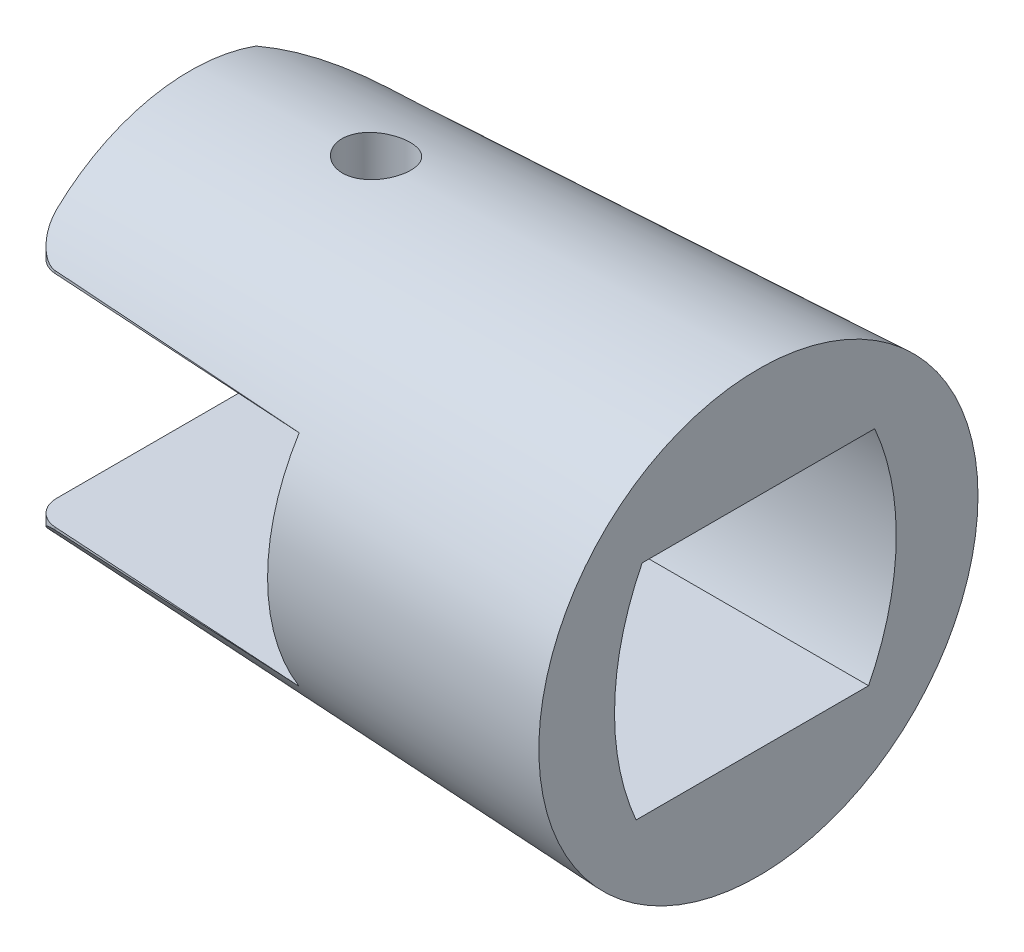
ISO-10303-21;
HEADER;
FILE_DESCRIPTION(('STEP AP214'),'2;1');
FILE_NAME('part.step','',(''),(''),'','','');
FILE_SCHEMA(('AUTOMOTIVE_DESIGN { 1 0 10303 214 1 1 1 1 }'));
ENDSEC;
DATA;
#1=APPLICATION_CONTEXT('core data for automotive mechanical design processes');
#2=APPLICATION_PROTOCOL_DEFINITION('international standard','automotive_design',2000,#1);
#3=PRODUCT_CONTEXT('',#1,'mechanical');
#4=PRODUCT('Part','Part','',(#3));
#5=PRODUCT_RELATED_PRODUCT_CATEGORY('part','',(#4));
#6=PRODUCT_DEFINITION_FORMATION('','',#4);
#7=PRODUCT_DEFINITION_CONTEXT('part definition',#1,'design');
#8=PRODUCT_DEFINITION('design','',#6,#7);
#9=PRODUCT_DEFINITION_SHAPE('','',#8);
#10=(LENGTH_UNIT() NAMED_UNIT(*) SI_UNIT(.MILLI.,.METRE.));
#11=(NAMED_UNIT(*) PLANE_ANGLE_UNIT() SI_UNIT($,.RADIAN.));
#12=(NAMED_UNIT(*) SI_UNIT($,.STERADIAN.) SOLID_ANGLE_UNIT());
#13=UNCERTAINTY_MEASURE_WITH_UNIT(LENGTH_MEASURE(1.E-05),#10,'distance_accuracy_value','');
#14=(GEOMETRIC_REPRESENTATION_CONTEXT(3) GLOBAL_UNCERTAINTY_ASSIGNED_CONTEXT((#13)) GLOBAL_UNIT_ASSIGNED_CONTEXT((#10,
#11,#12)) REPRESENTATION_CONTEXT('',''));
#15=CARTESIAN_POINT('',(0.,0.,0.));
#16=DIRECTION('',(0.,0.,1.));
#17=DIRECTION('',(1.,0.,0.));
#18=AXIS2_PLACEMENT_3D('',#15,#16,#17);
#19=CARTESIAN_POINT('',(-11.,0.,10.));
#20=DIRECTION('',(1.,0.,0.));
#21=DIRECTION('',(0.,0.,-1.));
#22=AXIS2_PLACEMENT_3D('',#19,#20,#21);
#23=PLANE('',#22);
#24=DIRECTION('',(0.,0.,-1.));
#25=VECTOR('',#24,1.);
#26=CARTESIAN_POINT('',(-11.,4.25,10.));
#27=LINE('',#26,#25);
#28=CARTESIAN_POINT('',(-11.,4.25,6.77772085586298));
#29=VERTEX_POINT('',#28);
#30=CARTESIAN_POINT('',(-11.,4.25,4.5));
#31=VERTEX_POINT('',#30);
#32=EDGE_CURVE('E238',#29,#31,#27,.T.);
#33=ORIENTED_EDGE('',*,*,#32,.T.);
#34=CARTESIAN_POINT('',(-11.,-0.249999999999947,-4.43028554974591));
#35=DIRECTION('',(1.,0.,0.));
#36=DIRECTION('',(0.,0.,-1.));
#37=AXIS2_PLACEMENT_3D('',#34,#35,#36);
#38=CIRCLE('',#37,10.);
#39=CARTESIAN_POINT('',(-11.,-4.25,4.73486584016575));
#40=VERTEX_POINT('',#39);
#41=EDGE_CURVE('E359',#31,#40,#38,.T.);
#42=ORIENTED_EDGE('',*,*,#41,.T.);
#43=DIRECTION('',(0.,0.,-1.));
#44=VECTOR('',#43,1.);
#45=CARTESIAN_POINT('',(-11.,-4.25,10.));
#46=LINE('',#45,#44);
#47=CARTESIAN_POINT('',(-11.,-4.25,6.77772085586298));
#48=VERTEX_POINT('',#47);
#49=EDGE_CURVE('E242',#48,#40,#46,.T.);
#50=ORIENTED_EDGE('',*,*,#49,.F.);
#51=CARTESIAN_POINT('',(-11.,0.,0.));
#52=DIRECTION('',(1.,0.,0.));
#53=DIRECTION('',(0.,0.,-1.));
#54=AXIS2_PLACEMENT_3D('',#51,#52,#53);
#55=CIRCLE('',#54,8.);
#56=EDGE_CURVE('E425',#48,#29,#55,.F.);
#57=ORIENTED_EDGE('',*,*,#56,.T.);
#58=EDGE_LOOP('',(#33,#42,#50,#57));
#59=FACE_BOUND('',#58,.T.);
#60=ADVANCED_FACE('F39',(#59),#23,.F.);
#61=CARTESIAN_POINT('',(-22.,0.,0.));
#62=DIRECTION('',(1.,0.,0.));
#63=DIRECTION('',(0.,0.,-1.));
#64=AXIS2_PLACEMENT_3D('',#61,#62,#63);
#65=CONICAL_SURFACE('',#64,7.5,0.0454232794215771);
#66=CARTESIAN_POINT('',(-16.1991105064426,7.64213239860376,-1.36838948473856));
#67=CARTESIAN_POINT('',(-16.1508958141531,7.63542076172434,-1.41830655928894));
#68=CARTESIAN_POINT('',(-16.0984640394933,7.62911627347668,-1.46425428633825));
#69=CARTESIAN_POINT('',(-15.9865616989317,7.61798266028014,-1.54688930956662));
#70=CARTESIAN_POINT('',(-15.9270857940176,7.6131546644773,-1.58356951471042));
#71=CARTESIAN_POINT('',(-15.802712395997,7.60556121739957,-1.64657757660265));
#72=CARTESIAN_POINT('',(-15.7378122849934,7.60279676852596,-1.6729003991531));
#73=CARTESIAN_POINT('',(-15.6044894198699,7.59976966951342,-1.71435496620886));
#74=CARTESIAN_POINT('',(-15.5360675880329,7.59950636768161,-1.72948962492742));
#75=CARTESIAN_POINT('',(-15.3986493193805,7.601678960494,-1.74800214952895));
#76=CARTESIAN_POINT('',(-15.3296735239488,7.60407800564145,-1.75153790545443));
#77=CARTESIAN_POINT('',(-15.1922197490342,7.61147677366023,-1.74724166449967));
#78=CARTESIAN_POINT('',(-15.1237417778008,7.61647653952937,-1.73940947966908));
#79=CARTESIAN_POINT('',(-14.9893122034088,7.62878729562398,-1.71270870352584));
#80=CARTESIAN_POINT('',(-14.9233566968642,7.63609453825562,-1.69385796559172));
#81=CARTESIAN_POINT('',(-14.7956032365479,7.65254635393307,-1.64575063446263));
#82=CARTESIAN_POINT('',(-14.7338057780463,7.66169114533623,-1.61649280426639));
#83=CARTESIAN_POINT('',(-14.6146164208518,7.68142115811766,-1.54765952743847));
#84=CARTESIAN_POINT('',(-14.5573538680598,7.69203400686407,-1.50786808141507));
#85=CARTESIAN_POINT('',(-14.4502759218419,7.71379780513905,-1.41939866566641));
#86=CARTESIAN_POINT('',(-14.4004616008841,7.72494883185447,-1.37071941842715));
#87=CARTESIAN_POINT('',(-14.308562494205,7.74727150917654,-1.26458252042323));
#88=CARTESIAN_POINT('',(-14.266672691938,7.75843817733606,-1.2069547552206));
#89=CARTESIAN_POINT('',(-14.1932084656516,7.7797615741078,-1.08528800075841));
#90=CARTESIAN_POINT('',(-14.1616339806865,7.78991830868673,-1.02124904938079));
#91=CARTESIAN_POINT('',(-14.1098588735166,7.80851391292312,-0.888725966160254));
#92=CARTESIAN_POINT('',(-14.0896222542327,7.81695816450501,-0.820256681647045));
#93=CARTESIAN_POINT('',(-14.061072971363,7.83165138460125,-0.680648621468626));
#94=CARTESIAN_POINT('',(-14.052758507449,7.83790068446094,-0.609510250519243));
#95=CARTESIAN_POINT('',(-14.0484522952261,7.84778514931267,-0.468304544460963));
#96=CARTESIAN_POINT('',(-14.0521855342659,7.85147635133582,-0.398249476364143));
#97=CARTESIAN_POINT('',(-14.071329170513,7.85640983357746,-0.259667810323408));
#98=CARTESIAN_POINT('',(-14.0867385243256,7.85765233257991,-0.191141076368558));
#99=CARTESIAN_POINT('',(-14.128492897101,7.85785284225483,-0.058605743907525));
#100=CARTESIAN_POINT('',(-14.1546754138614,7.85684385409155,0.00545411413245929));
#101=CARTESIAN_POINT('',(-14.2172061762014,7.8529554420828,0.128339672817716));
#102=CARTESIAN_POINT('',(-14.2535547688558,7.85007595437311,0.187165194669775));
#103=CARTESIAN_POINT('',(-14.33564939293,7.84290661884702,0.298331454790711));
#104=CARTESIAN_POINT('',(-14.3814541520736,7.83860785145139,0.35062822183059));
#105=CARTESIAN_POINT('',(-14.4810394588978,7.82917620282735,0.446889941699957));
#106=CARTESIAN_POINT('',(-14.5348206521234,7.82404325408415,0.490854219511729));
#107=CARTESIAN_POINT('',(-14.6496931312128,7.81345670361802,0.569825204161493));
#108=CARTESIAN_POINT('',(-14.7108758925215,7.80799962872127,0.604698457611458));
#109=CARTESIAN_POINT('',(-14.8382444432748,7.79739564393625,0.6637044897007));
#110=CARTESIAN_POINT('',(-14.9044303303778,7.79224874010588,0.687837058623818));
#111=CARTESIAN_POINT('',(-15.0402241368509,7.78270476049587,0.72473880536946));
#112=CARTESIAN_POINT('',(-15.1098440907648,7.77831060474813,0.737464507047952));
#113=CARTESIAN_POINT('',(-15.2502912846662,7.77060175559334,0.751001880492983));
#114=CARTESIAN_POINT('',(-15.3211184785031,7.767287021019,0.751814006675144));
#115=CARTESIAN_POINT('',(-15.4615301135133,7.76186641491048,0.741504998097269));
#116=CARTESIAN_POINT('',(-15.5311193880888,7.75975362099767,0.730453277969864));
#117=CARTESIAN_POINT('',(-15.6674801831399,7.75662221504508,0.696824735222845));
#118=CARTESIAN_POINT('',(-15.7342517323173,7.75560359185731,0.674248030029435));
#119=CARTESIAN_POINT('',(-15.8628851054713,7.75439899973845,0.618287283442594));
#120=CARTESIAN_POINT('',(-15.9247600998771,7.75421071707963,0.584933551104948));
#121=CARTESIAN_POINT('',(-16.0420578125317,7.75426433037923,0.508343495615129));
#122=CARTESIAN_POINT('',(-16.0974803849768,7.7545062360565,0.465106949208793));
#123=CARTESIAN_POINT('',(-16.2004511088615,7.75494768906834,0.369839556377424));
#124=CARTESIAN_POINT('',(-16.2479773370052,7.75514711889195,0.317785010074491));
#125=CARTESIAN_POINT('',(-16.33362259248,7.75501450579899,0.206439946900698));
#126=CARTESIAN_POINT('',(-16.3717416868938,7.75468246667248,0.147149481634012));
#127=CARTESIAN_POINT('',(-16.437483487879,7.75305536372848,0.0230317553152771));
#128=CARTESIAN_POINT('',(-16.4651077721284,7.7517604447467,-0.0417946717232883));
#129=CARTESIAN_POINT('',(-16.5090837599272,7.74789483036569,-0.175125147731818));
#130=CARTESIAN_POINT('',(-16.5254361602932,7.74532421384571,-0.243628969086713));
#131=CARTESIAN_POINT('',(-16.5463860889201,7.73877397471131,-0.38207858523554));
#132=CARTESIAN_POINT('',(-16.5510276678073,7.73479969655463,-0.452017975678318));
#133=CARTESIAN_POINT('',(-16.5485915654112,7.72548754817343,-0.59161330924282));
#134=CARTESIAN_POINT('',(-16.5415116273113,7.72014941552488,-0.661269195191051));
#135=CARTESIAN_POINT('',(-16.5158437856867,7.70833750676838,-0.798518169432213));
#136=CARTESIAN_POINT('',(-16.4972245671329,7.70186067486092,-0.866105117574989));
#137=CARTESIAN_POINT('',(-16.4490137309468,7.68820545400156,-0.997124780343338));
#138=CARTESIAN_POINT('',(-16.4194307611689,7.68102762125416,-1.06056072287359));
#139=CARTESIAN_POINT('',(-16.3591222362737,7.66840925157617,-1.16590935920253));
#140=CARTESIAN_POINT('',(-16.3306707233596,7.66299948879188,-1.20914558818589));
#141=CARTESIAN_POINT('',(-16.2686303426236,7.65236191060591,-1.29178587179423));
#142=CARTESIAN_POINT('',(-16.2350414332522,7.64713409667618,-1.33118989542148));
#143=CARTESIAN_POINT('',(-16.1991105064426,7.64213239860376,-1.36838948473856));
#144=B_SPLINE_CURVE_WITH_KNOTS('',3,(#66,#67,#68,#69,#70,#71,#72,#73,#74,#75,#76,#77,#78,#79,
#80,#81,#82,#83,#84,#85,#86,#87,#88,#89,#90,#91,#92,#93,#94,#95,#96,#97,#98,#99,#100,#101,#102,
#103,#104,#105,#106,#107,#108,#109,#110,#111,#112,#113,#114,#115,#116,#117,#118,#119,#120,#121,
#122,#123,#124,#125,#126,#127,#128,#129,#130,#131,#132,#133,#134,#135,#136,#137,#138,#139,#140,
#141,#142,#143),.UNSPECIFIED.,.T.,.F.,(4,2,2,2,2,2,2,2,2,2,2,2,2,2,2,2,2,2,2,2,2,2,2,2,2,2,2,2,
2,2,2,2,2,2,2,2,2,2,4),(0.,0.20898815908834,0.41813574427288,0.627384860280111,
0.836579453344756,1.04291430318027,1.24925256446439,1.45525741870395,1.66128676715023,
1.87192122846896,2.08258598981495,2.29790285538215,2.51321844877551,2.72784649621161,
2.94244212990628,3.15217414289225,3.36188741612846,3.56854703875268,3.77521371769965,
3.98320475141169,4.19121262735113,4.40212098182154,4.61303345418124,4.82474642188118,
5.03645131426148,5.24692425172714,5.45739504476097,5.66727899295867,5.87716768293301,
6.08762970444704,6.29809022510347,6.50851909483774,6.71893495490389,6.92855814100928,
7.13822169186476,7.3484567293843,7.55852629197703,7.71426880857834,7.87001258483612),.UNSPECIFIED.);
#145=CARTESIAN_POINT('',(-16.1991105064426,7.64213239860376,-1.36838948473856));
#146=VERTEX_POINT('',#145);
#147=EDGE_CURVE('E176',#146,#146,#144,.T.);
#148=ORIENTED_EDGE('',*,*,#147,.T.);
#149=EDGE_LOOP('',(#148));
#150=FACE_BOUND('',#149,.T.);
#151=CARTESIAN_POINT('',(-41.5118530495364,0.,4.90960169713127));
#152=DIRECTION('',(-0.0611115794993297,0.,0.998130940734279));
#153=DIRECTION('',(0.998130940734279,0.,0.0611115794993297));
#154=AXIS2_PLACEMENT_3D('',#151,#152,#153);
#155=ELLIPSE('',#154,108.213494771976,4.43044815934391);
#156=CARTESIAN_POINT('',(-21.0611115794994,-4.35030922266395,6.16171909191617));
#157=VERTEX_POINT('',#156);
#158=EDGE_CURVE('E400',#48,#157,#155,.F.);
#159=ORIENTED_EDGE('',*,*,#158,.T.);
#160=CARTESIAN_POINT('',(-21.0611115794993,-4.35030922266395,6.16171909191617));
#161=CARTESIAN_POINT('',(-21.0960747914109,-4.35051356340758,6.15962202294587));
#162=CARTESIAN_POINT('',(-21.1307813214346,-4.35346778045731,6.15561243833207));
#163=CARTESIAN_POINT('',(-21.1985190771024,-4.36415418241963,6.14426807244674));
#164=CARTESIAN_POINT('',(-21.2315642056245,-4.3718351604082,6.13696914977953));
#165=CARTESIAN_POINT('',(-21.3035295203859,-4.39369648239994,6.11731554569819));
#166=CARTESIAN_POINT('',(-21.3418761871241,-4.40901577852048,6.10415620522647));
#167=CARTESIAN_POINT('',(-21.4149283606298,-4.44443557078691,6.07430260660561));
#168=CARTESIAN_POINT('',(-21.4496163023613,-4.46455774127447,6.05759236262458));
#169=CARTESIAN_POINT('',(-21.531946468789,-4.51931086063731,6.01225519576181));
#170=CARTESIAN_POINT('',(-21.5771775571261,-4.55610872004904,5.98189606961668));
#171=CARTESIAN_POINT('',(-21.6598615980811,-4.6342222492668,5.91681901434334));
#172=CARTESIAN_POINT('',(-21.6972980555852,-4.67554722314516,5.88209208602675));
#173=CARTESIAN_POINT('',(-21.7830311966419,-4.78319627199736,5.79019145424798));
#174=CARTESIAN_POINT('',(-21.8267397409008,-4.85127319447803,5.73079069632704));
#175=CARTESIAN_POINT('',(-21.8996051814965,-4.98975683289049,5.60620400269983));
#176=CARTESIAN_POINT('',(-21.9287525468712,-5.06016504269773,5.54101431065619));
#177=CARTESIAN_POINT('',(-21.9669423984771,-5.18258484226127,5.42388394775105));
#178=CARTESIAN_POINT('',(-21.9792550755708,-5.2345697331447,5.37296218184321));
#179=CARTESIAN_POINT('',(-21.9957467088538,-5.33772131710358,5.26944127270405));
#180=CARTESIAN_POINT('',(-21.9999586548459,-5.38889048351514,5.2168498232289));
#181=CARTESIAN_POINT('',(-21.9999999999995,-5.43942713814805,5.16358716482823));
#182=B_SPLINE_CURVE_WITH_KNOTS('',3,(#160,#161,#162,#163,#164,#165,#166,#167,#168,#169,#170,
#171,#172,#173,#174,#175,#176,#177,#178,#179,#180,#181),.UNSPECIFIED.,.F.,.F.,(4,2,2,2,2,2,2,2,
2,2,4),(0.,0.104737956290573,0.20836074561613,0.337663511366164,0.467561208549421,
0.663680584398123,0.860210864778958,1.15972124568397,1.45942741390104,1.68039223758089,
1.90045527217779),.UNSPECIFIED.);
#183=CARTESIAN_POINT('',(-22.,-5.43942765765587,5.16358765802045));
#184=VERTEX_POINT('',#183);
#185=EDGE_CURVE('E292',#157,#184,#182,.T.);
#186=ORIENTED_EDGE('',*,*,#185,.T.);
#187=CARTESIAN_POINT('',(-22.,0.,0.));
#188=DIRECTION('',(1.,0.,0.));
#189=DIRECTION('',(0.,0.,-1.));
#190=AXIS2_PLACEMENT_3D('',#187,#188,#189);
#191=CIRCLE('',#190,7.5);
#192=CARTESIAN_POINT('',(-21.9999999999998,-7.05225000259581,-2.55260061523294));
#193=VERTEX_POINT('',#192);
#194=EDGE_CURVE('E257',#184,#193,#191,.T.);
#195=ORIENTED_EDGE('',*,*,#194,.T.);
#196=CARTESIAN_POINT('',(-16.5272227634073,-3.91896344353208,-6.684687530857));
#197=CARTESIAN_POINT('',(-16.6427127671059,-3.95329674635129,-6.65847955556438));
#198=CARTESIAN_POINT('',(-16.7566693164258,-3.99085174347405,-6.63004153669327));
#199=CARTESIAN_POINT('',(-16.9814370959532,-4.07124785328741,-6.56895905885342));
#200=CARTESIAN_POINT('',(-17.0922510678245,-4.11408417226116,-6.53631841332278));
#201=CARTESIAN_POINT('',(-17.3105332665758,-4.20381588665415,-6.46714088297935));
#202=CARTESIAN_POINT('',(-17.4180105859096,-4.25069863463741,-6.43061606093192));
#203=CARTESIAN_POINT('',(-17.6301048386284,-4.34772844122679,-6.35373913994798));
#204=CARTESIAN_POINT('',(-17.7347210411814,-4.39787632300832,-6.31338607468899));
#205=CARTESIAN_POINT('',(-18.0447644315248,-4.5521525011536,-6.18664455827059));
#206=CARTESIAN_POINT('',(-18.2460892693231,-4.65998636071397,-6.09466885439665));
#207=CARTESIAN_POINT('',(-18.6388142973702,-4.88064755111759,-5.89629879498852));
#208=CARTESIAN_POINT('',(-18.8302055665367,-4.99347920742176,-5.78989177859903));
#209=CARTESIAN_POINT('',(-19.2013077328751,-5.21918797308576,-5.56413300492337));
#210=CARTESIAN_POINT('',(-19.3811286353753,-5.33204927424095,-5.4449462930683));
#211=CARTESIAN_POINT('',(-19.7315405271321,-5.5563305825324,-5.19258525325173));
#212=CARTESIAN_POINT('',(-19.902133820893,-5.66775094419051,-5.05941444234583));
#213=CARTESIAN_POINT('',(-20.2334519196861,-5.88654777947444,-4.77921817415432));
#214=CARTESIAN_POINT('',(-20.3941996852896,-5.99393341697105,-4.63222714993483));
#215=CARTESIAN_POINT('',(-20.7055597270612,-6.20270444576696,-4.32401521420343));
#216=CARTESIAN_POINT('',(-20.8561739450322,-6.30409098616918,-4.16279704268034));
#217=CARTESIAN_POINT('',(-21.1878961239379,-6.52657567812968,-3.77774033897472));
#218=CARTESIAN_POINT('',(-21.3653992935145,-6.64501396174254,-3.54918276892559));
#219=CARTESIAN_POINT('',(-21.6995216755857,-6.86375180811079,-3.06823085541814));
#220=CARTESIAN_POINT('',(-21.8560787946518,-6.96399774059342,-2.81576926932262));
#221=CARTESIAN_POINT('',(-22.0003080623877,-7.0524389734962,-2.55203732001921));
#222=B_SPLINE_CURVE_WITH_KNOTS('',3,(#196,#197,#198,#199,#200,#201,#202,#203,#204,#205,#206,
#207,#208,#209,#210,#211,#212,#213,#214,#215,#216,#217,#218,#219,#220,#221),.UNSPECIFIED.,.F.,
.F.,(4,2,2,2,2,2,2,2,2,2,2,2,4),(0.,0.369742220096412,0.739151272096876,1.10744485071781,
1.47583164236118,2.21361214682884,2.95204415797171,3.68188313790468,4.41153899812975,
5.13942280519199,5.86716673466465,6.80312857828965,7.74180629803889),.UNSPECIFIED.);
#223=CARTESIAN_POINT('',(-17.4146827218211,-4.25,-6.43096361755301));
#224=VERTEX_POINT('',#223);
#225=EDGE_CURVE('E230',#224,#193,#222,.T.);
#226=ORIENTED_EDGE('',*,*,#225,.F.);
#227=CARTESIAN_POINT('',(-33.8126852718489,-4.25,-5.5155871153025));
#228=CARTESIAN_POINT('',(-31.3853699075223,-4.25,-5.65483903287506));
#229=CARTESIAN_POINT('',(-28.957947196194,-4.25,-5.79220398289213));
#230=CARTESIAN_POINT('',(-24.102926214611,-4.25,-6.06376035771553));
#231=CARTESIAN_POINT('',(-21.6753279445077,-4.25,-6.1979517852292));
#232=CARTESIAN_POINT('',(-16.8199914715129,-4.25,-6.46376172585246));
#233=CARTESIAN_POINT('',(-14.392253268658,-4.25,-6.59538023963274));
#234=CARTESIAN_POINT('',(-9.53665959490313,-4.25,-6.85645963504762));
#235=CARTESIAN_POINT('',(-7.10880412393918,-4.25,-6.98592051549281));
#236=CARTESIAN_POINT('',(-1.41358013309213,-4.25,-7.28746835630175));
#237=CARTESIAN_POINT('',(1.85382742252967,-4.25,-7.45881773024276));
#238=CARTESIAN_POINT('',(8.38878193375573,-4.25,-7.79884413360508));
#239=CARTESIAN_POINT('',(11.6563288893827,-4.25,-7.96752116258884));
#240=CARTESIAN_POINT('',(18.1915294937373,-4.25,-8.3026724390855));
#241=CARTESIAN_POINT('',(21.4591831422524,-4.25,-8.46914669074715));
#242=CARTESIAN_POINT('',(27.9945834199728,-4.25,-8.80023650372375));
#243=CARTESIAN_POINT('',(31.2623300491432,-4.25,-8.96485206572805));
#244=CARTESIAN_POINT('',(34.5301144470347,-4.25,-9.1287102280395));
#245=B_SPLINE_CURVE_WITH_KNOTS('',3,(#227,#228,#229,#230,#231,#232,#233,#234,#235,#236,#237,
#238,#239,#240,#241,#242,#243,#244),.UNSPECIFIED.,.F.,.F.,(4,2,2,2,2,2,2,2,4),(0.,
7.29391725989147,14.5878282970991,21.8817374329576,29.1756505895328,38.9913414305139,
48.8070338786212,58.6227078370245,68.438378154867),.UNSPECIFIED.);
#246=CARTESIAN_POINT('',(-11.,-4.25,-6.77772085586298));
#247=VERTEX_POINT('',#246);
#248=EDGE_CURVE('E311',#224,#247,#245,.T.);
#249=ORIENTED_EDGE('',*,*,#248,.T.);
#250=CARTESIAN_POINT('',(-11.,4.25,-6.77772085586298));
#251=VERTEX_POINT('',#250);
#252=EDGE_CURVE('E316',#251,#247,#55,.F.);
#253=ORIENTED_EDGE('',*,*,#252,.F.);
#254=CARTESIAN_POINT('',(-33.8126852718489,4.25,-5.5155871153025));
#255=CARTESIAN_POINT('',(-31.3853699075223,4.25,-5.65483903287507));
#256=CARTESIAN_POINT('',(-28.957947196194,4.25,-5.79220398289214));
#257=CARTESIAN_POINT('',(-24.102926214611,4.25,-6.06376035771554));
#258=CARTESIAN_POINT('',(-21.6753279445077,4.25,-6.19795178522921));
#259=CARTESIAN_POINT('',(-16.8199914715129,4.25,-6.46376172585246));
#260=CARTESIAN_POINT('',(-14.392253268658,4.25,-6.59538023963274));
#261=CARTESIAN_POINT('',(-9.53665959490313,4.25,-6.85645963504762));
#262=CARTESIAN_POINT('',(-7.10880412393918,4.25,-6.98592051549281));
#263=CARTESIAN_POINT('',(-1.41358013309214,4.25,-7.28746835630175));
#264=CARTESIAN_POINT('',(1.85382742252966,4.25,-7.45881773024276));
#265=CARTESIAN_POINT('',(8.38878193375571,4.25,-7.79884413360508));
#266=CARTESIAN_POINT('',(11.6563288893827,4.25,-7.96752116258884));
#267=CARTESIAN_POINT('',(18.1915294937373,4.25,-8.3026724390855));
#268=CARTESIAN_POINT('',(21.4591831422524,4.25,-8.46914669074715));
#269=CARTESIAN_POINT('',(27.9945834199728,4.25,-8.80023650372375));
#270=CARTESIAN_POINT('',(31.2623300491432,4.25,-8.96485206572805));
#271=CARTESIAN_POINT('',(34.5301144470347,4.25,-9.1287102280395));
#272=B_SPLINE_CURVE_WITH_KNOTS('',3,(#254,#255,#256,#257,#258,#259,#260,#261,#262,#263,#264,
#265,#266,#267,#268,#269,#270,#271),.UNSPECIFIED.,.F.,.F.,(4,2,2,2,2,2,2,2,4),(0.,
7.29391725989147,14.5878282970991,21.8817374329576,29.1756505895328,38.9913414305139,
48.8070338786212,58.6227078370245,68.438378154867),.UNSPECIFIED.);
#273=CARTESIAN_POINT('',(-17.4146827218211,4.25,-6.43096361755301));
#274=VERTEX_POINT('',#273);
#275=EDGE_CURVE('E424',#251,#274,#272,.F.);
#276=ORIENTED_EDGE('',*,*,#275,.T.);
#277=CARTESIAN_POINT('',(-22.0003080623877,7.0524389734962,-2.55203732001921));
#278=CARTESIAN_POINT('',(-21.8865501625451,6.98266926908595,-2.76006889586726));
#279=CARTESIAN_POINT('',(-21.7650667699985,6.90553513148157,-2.96115407159308));
#280=CARTESIAN_POINT('',(-21.508493529345,6.73917648584937,-3.34864268637224));
#281=CARTESIAN_POINT('',(-21.3734265500854,6.64997221400663,-3.53506989034863));
#282=CARTESIAN_POINT('',(-21.0914944642558,6.4620983081212,-3.8926999624019));
#283=CARTESIAN_POINT('',(-20.9446595735615,6.36345279678775,-4.0639395844802));
#284=CARTESIAN_POINT('',(-20.6400538581137,6.15879267743817,-4.39176817948242));
#285=CARTESIAN_POINT('',(-20.4822783291448,6.05277489946614,-4.54835078138103));
#286=CARTESIAN_POINT('',(-20.1578370784349,5.83643149189731,-4.84588988896659));
#287=CARTESIAN_POINT('',(-19.9912387897799,5.72613989346029,-4.98694502527183));
#288=CARTESIAN_POINT('',(-19.6486850111953,5.50289121690271,-5.25481733215771));
#289=CARTESIAN_POINT('',(-19.4727300721882,5.38993429593453,-5.38163533965996));
#290=CARTESIAN_POINT('',(-19.1117869780169,5.16405221946017,-5.62103306771884));
#291=CARTESIAN_POINT('',(-18.9268105416526,5.05112720480102,-5.73363061176831));
#292=CARTESIAN_POINT('',(-18.5472878152095,4.82822203601791,-5.94478562930339));
#293=CARTESIAN_POINT('',(-18.3527425637343,4.71824156428428,-6.04334462203561));
#294=CARTESIAN_POINT('',(-18.0265884245266,4.54434936735566,-6.19261987574077));
#295=CARTESIAN_POINT('',(-17.8980562277181,4.47833109034495,-6.24762842784334));
#296=CARTESIAN_POINT('',(-17.6366586028298,4.35049937851545,-6.3517121623919));
#297=CARTESIAN_POINT('',(-17.5037958087032,4.28868345582808,-6.40079086902872));
#298=CARTESIAN_POINT('',(-17.2332414308166,4.17077976931123,-6.49285379079453));
#299=CARTESIAN_POINT('',(-17.0955443981608,4.11469876746748,-6.53583083417332));
#300=CARTESIAN_POINT('',(-16.8151295178568,4.01037735782446,-6.61527669848076));
#301=CARTESIAN_POINT('',(-16.6724037043015,3.96215013893154,-6.65173458160315));
#302=CARTESIAN_POINT('',(-16.5272227634072,3.91896344353208,-6.68468753085701));
#303=B_SPLINE_CURVE_WITH_KNOTS('',3,(#277,#278,#279,#280,#281,#282,#283,#284,#285,#286,#287,
#288,#289,#290,#291,#292,#293,#294,#295,#296,#297,#298,#299,#300,#301,#302),.UNSPECIFIED.,.F.,
.F.,(4,2,2,2,2,2,2,2,2,2,2,2,4),(0.,0.740833951218997,1.48044090115842,2.21820616396747,
2.95629063927878,3.68937726721113,4.42242077846857,5.15453619976111,5.88657233151188,
6.35021514569359,6.81358104068867,7.27748713433333,7.74216440921874),.UNSPECIFIED.);
#304=CARTESIAN_POINT('',(-21.9999999999999,7.05225000259585,-2.55260061523282));
#305=VERTEX_POINT('',#304);
#306=EDGE_CURVE('E396',#305,#274,#303,.T.);
#307=ORIENTED_EDGE('',*,*,#306,.F.);
#308=CARTESIAN_POINT('',(-22.,5.43942732783755,5.16358776971788));
#309=VERTEX_POINT('',#308);
#310=EDGE_CURVE('E44',#305,#309,#191,.T.);
#311=ORIENTED_EDGE('',*,*,#310,.T.);
#312=CARTESIAN_POINT('',(-21.9999999999997,5.43942692599864,5.16358738831069));
#313=CARTESIAN_POINT('',(-21.999988013143,5.40184320556245,5.20318749921114));
#314=CARTESIAN_POINT('',(-21.9976480658442,5.36390633417556,5.24243191883521));
#315=CARTESIAN_POINT('',(-21.9884703459431,5.2875949713991,5.3199754661269));
#316=CARTESIAN_POINT('',(-21.9816316889269,5.24922039541796,5.35827440638373));
#317=CARTESIAN_POINT('',(-21.9635351279353,5.17197734108679,5.43401065216798));
#318=CARTESIAN_POINT('',(-21.952238686453,5.13310749569211,5.47143734588329));
#319=CARTESIAN_POINT('',(-21.9252941853482,5.05553834603688,5.54484730589776));
#320=CARTESIAN_POINT('',(-21.9096469965899,5.01683900921972,5.58083085941441));
#321=CARTESIAN_POINT('',(-21.8632877834427,4.91690464192796,5.67223267566103));
#322=CARTESIAN_POINT('',(-21.8291655895984,4.85605246576613,5.7263849970058));
#323=CARTESIAN_POINT('',(-21.7490883355968,4.73783831693094,5.82925153926951));
#324=CARTESIAN_POINT('',(-21.7031758270755,4.68046469182239,5.87798443108639));
#325=CARTESIAN_POINT('',(-21.6195957077943,4.59501073033797,5.94955989537241));
#326=CARTESIAN_POINT('',(-21.5863438669347,4.56461212732682,5.97478784894987));
#327=CARTESIAN_POINT('',(-21.514689351926,4.50752819548121,6.02203687691116));
#328=CARTESIAN_POINT('',(-21.4762913016731,4.4808395765597,6.0440607935155));
#329=CARTESIAN_POINT('',(-21.4033826848435,4.43849136775602,6.07930060925859));
#330=CARTESIAN_POINT('',(-21.3699558302646,4.42170244710058,6.09338213602483));
#331=CARTESIAN_POINT('',(-21.3000779214319,4.39272075778112,6.118218433634));
#332=CARTESIAN_POINT('',(-21.2636378052955,4.38051218532723,6.12898462006588));
#333=CARTESIAN_POINT('',(-21.1994895435668,4.36464569516296,6.14386507669782));
#334=CARTESIAN_POINT('',(-21.1723796392173,4.35952747256111,6.14900480397172));
#335=CARTESIAN_POINT('',(-21.1172658201509,4.35244450096266,6.15708677223797));
#336=CARTESIAN_POINT('',(-21.0892574866906,4.3504990307251,6.16001552124293));
#337=CARTESIAN_POINT('',(-21.0611115794994,4.35030922266381,6.16171909191617));
#338=B_SPLINE_CURVE_WITH_KNOTS('',3,(#312,#313,#314,#315,#316,#317,#318,#319,#320,#321,#322,
#323,#324,#325,#326,#327,#328,#329,#330,#331,#332,#333,#334,#335,#336,#337),.UNSPECIFIED.,.F.,
.F.,(4,2,2,2,2,2,2,2,2,2,2,2,4),(0.,0.16371410731572,0.327460409265002,0.492654448520601,
0.657815445605374,0.921882738986487,1.18501008005081,1.33955753350556,1.49396704473969,
1.61346780524258,1.73255236957522,1.8164792910756,1.90091430726266),.UNSPECIFIED.);
#339=CARTESIAN_POINT('',(-21.0611115794993,4.35030922266395,6.16171909191617));
#340=VERTEX_POINT('',#339);
#341=EDGE_CURVE('E352',#309,#340,#338,.T.);
#342=ORIENTED_EDGE('',*,*,#341,.T.);
#343=EDGE_CURVE('E305',#340,#29,#155,.F.);
#344=ORIENTED_EDGE('',*,*,#343,.T.);
#345=ORIENTED_EDGE('',*,*,#56,.F.);
#346=EDGE_LOOP('',(#159,#186,#195,#226,#249,#253,#276,#307,#311,#342,#344,#345));
#347=FACE_BOUND('',#346,.T.);
#348=CARTESIAN_POINT('',(0.,0.,0.));
#349=DIRECTION('',(1.,0.,0.));
#350=DIRECTION('',(0.,0.,-1.));
#351=AXIS2_PLACEMENT_3D('',#348,#349,#350);
#352=CIRCLE('',#351,8.5);
#353=CARTESIAN_POINT('',(0.,0.,-8.5));
#354=VERTEX_POINT('',#353);
#355=EDGE_CURVE('E268',#354,#354,#352,.T.);
#356=ORIENTED_EDGE('',*,*,#355,.F.);
#357=EDGE_LOOP('',(#356));
#358=FACE_BOUND('',#357,.T.);
#359=CARTESIAN_POINT('',(-16.1991105064426,-7.64213239860376,-1.36838948473856));
#360=CARTESIAN_POINT('',(-16.2481183827204,-7.64895517152965,-1.31764401423421));
#361=CARTESIAN_POINT('',(-16.2928225988122,-7.65620590986641,-1.2627403660346));
#362=CARTESIAN_POINT('',(-16.37236519701,-7.67086859718286,-1.14615969551993));
#363=CARTESIAN_POINT('',(-16.4071930934637,-7.67828070857147,-1.0844755700633));
#364=CARTESIAN_POINT('',(-16.4659627346481,-7.6926297415254,-0.956083213808689));
#365=CARTESIAN_POINT('',(-16.4899073685247,-7.69956678878873,-0.889376321876583));
#366=CARTESIAN_POINT('',(-16.526205490571,-7.71245877414565,-0.752806403240237));
#367=CARTESIAN_POINT('',(-16.5385621313391,-7.71841397899307,-0.682944240375051));
#368=CARTESIAN_POINT('',(-16.5512688819341,-7.72898635674714,-0.542314737588601));
#369=CARTESIAN_POINT('',(-16.5516663271452,-7.73360873306219,-0.47155207567303));
#370=CARTESIAN_POINT('',(-16.5405157515085,-7.74141012691772,-0.330891636510256));
#371=CARTESIAN_POINT('',(-16.5289678410068,-7.7445891577908,-0.260993851279729));
#372=CARTESIAN_POINT('',(-16.4943843307592,-7.74954946577903,-0.124706035435113));
#373=CARTESIAN_POINT('',(-16.4714505175338,-7.75134277405434,-0.0582905883346276));
#374=CARTESIAN_POINT('',(-16.4147865909779,-7.75382400633057,0.0697844754463724));
#375=CARTESIAN_POINT('',(-16.3810564620315,-7.75451192873267,0.131444085247932));
#376=CARTESIAN_POINT('',(-16.3037673891173,-7.7551677009176,0.248233235743787));
#377=CARTESIAN_POINT('',(-16.2602116731153,-7.75513578684572,0.303364911987125));
#378=CARTESIAN_POINT('',(-16.1644935955388,-7.7548204006079,0.40556770299564));
#379=CARTESIAN_POINT('',(-16.1123310658582,-7.75453692352801,0.452638660284246));
#380=CARTESIAN_POINT('',(-16.0006669817598,-7.75420336587905,0.537546499284532));
#381=CARTESIAN_POINT('',(-15.9411398196981,-7.75415412458617,0.57534971632979));
#382=CARTESIAN_POINT('',(-15.8165874117901,-7.75473204121915,0.64042727097625));
#383=CARTESIAN_POINT('',(-15.7515622523834,-7.75535918851265,0.667701774072472));
#384=CARTESIAN_POINT('',(-15.6179450146916,-7.7576159419089,0.710923579362009));
#385=CARTESIAN_POINT('',(-15.5493569212995,-7.7592444492561,0.726883255630492));
#386=CARTESIAN_POINT('',(-15.4105138744871,-7.76366635977606,0.747079761543385));
#387=CARTESIAN_POINT('',(-15.3402589487757,-7.76645974359696,0.751316785924929));
#388=CARTESIAN_POINT('',(-15.200235688324,-7.77317632835658,0.747974940222434));
#389=CARTESIAN_POINT('',(-15.1304666402132,-7.77709713627154,0.740420948430935));
#390=CARTESIAN_POINT('',(-14.9932240242938,-7.78585111175639,0.713785525557175));
#391=CARTESIAN_POINT('',(-14.9257505404352,-7.79068431265075,0.694703673372336));
#392=CARTESIAN_POINT('',(-14.7946866470933,-7.8008962267867,0.645460711922345));
#393=CARTESIAN_POINT('',(-14.7311141966589,-7.80627719797367,0.615252279842094));
#394=CARTESIAN_POINT('',(-14.6099253001897,-7.81704451765887,0.544613098263318));
#395=CARTESIAN_POINT('',(-14.5523091229652,-7.82243086638872,0.504181887687756));
#396=CARTESIAN_POINT('',(-14.4443738043172,-7.83263588662694,0.413987675921974));
#397=CARTESIAN_POINT('',(-14.3940910944341,-7.83745170300577,0.364180724484842));
#398=CARTESIAN_POINT('',(-14.3025956584595,-7.84586659319037,0.256744530870512));
#399=CARTESIAN_POINT('',(-14.2613825380846,-7.8494657198931,0.199115628914228));
#400=CARTESIAN_POINT('',(-14.189483896508,-7.85486692463116,0.078078620699237));
#401=CARTESIAN_POINT('',(-14.1587287890357,-7.85668103938802,0.0147124147773366));
#402=CARTESIAN_POINT('',(-14.1082781368869,-7.85812665344954,-0.11630086289614));
#403=CARTESIAN_POINT('',(-14.088581401632,-7.85775838776536,-0.183947472933266));
#404=CARTESIAN_POINT('',(-14.0610141622421,-7.85461726443622,-0.320553717132363));
#405=CARTESIAN_POINT('',(-14.0529801237809,-7.8518785348391,-0.389481188414362));
#406=CARTESIAN_POINT('',(-14.0483960968981,-7.84401865521448,-0.527577811926687));
#407=CARTESIAN_POINT('',(-14.051845848791,-7.83889755906222,-0.596746958656619));
#408=CARTESIAN_POINT('',(-14.0700294102141,-7.82647813621979,-0.733249679113928));
#409=CARTESIAN_POINT('',(-14.0847427666735,-7.81918377051993,-0.800586351096398));
#410=CARTESIAN_POINT('',(-14.1249226577547,-7.80280320625325,-0.931739134682005));
#411=CARTESIAN_POINT('',(-14.150390270654,-7.79371682805867,-0.995554892534385));
#412=CARTESIAN_POINT('',(-14.2118776098388,-7.77411763275919,-1.11914531449365));
#413=CARTESIAN_POINT('',(-14.2480832646701,-7.7635816009524,-1.17882375639454));
#414=CARTESIAN_POINT('',(-14.3298371577788,-7.74190517918116,-1.29127630226849));
#415=CARTESIAN_POINT('',(-14.3753867474308,-7.73076470196987,-1.34404940574071));
#416=CARTESIAN_POINT('',(-14.4756640587273,-7.70840174580074,-1.442337664681));
#417=CARTESIAN_POINT('',(-14.5305627811624,-7.69718237067437,-1.48767927970149));
#418=CARTESIAN_POINT('',(-14.6473838007255,-7.67570718163399,-1.56847345685151));
#419=CARTESIAN_POINT('',(-14.7093061531226,-7.66545137530348,-1.60392594115566));
#420=CARTESIAN_POINT('',(-14.8383565772616,-7.64667590262604,-1.6638011806514));
#421=CARTESIAN_POINT('',(-14.9054729602838,-7.63815248603518,-1.68824790346038));
#422=CARTESIAN_POINT('',(-15.0431225363433,-7.62343282087657,-1.72539502248808));
#423=CARTESIAN_POINT('',(-15.113655024855,-7.61723609474822,-1.73809782996621));
#424=CARTESIAN_POINT('',(-15.2542572570359,-7.60769797731069,-1.75110654954651));
#425=CARTESIAN_POINT('',(-15.3242945387061,-7.60428911895962,-1.75171424436526));
#426=CARTESIAN_POINT('',(-15.4635778143712,-7.60020475421617,-1.74121655666613));
#427=CARTESIAN_POINT('',(-15.5328237473572,-7.59952945716798,-1.73011027713968));
#428=CARTESIAN_POINT('',(-15.6672534150568,-7.60077360174533,-1.69680315811014));
#429=CARTESIAN_POINT('',(-15.7324873663926,-7.60264731246227,-1.67480224150436));
#430=CARTESIAN_POINT('',(-15.858341565984,-7.60856426721052,-1.62046637821591));
#431=CARTESIAN_POINT('',(-15.9189658030527,-7.61260561061213,-1.58814049472842));
#432=CARTESIAN_POINT('',(-16.0169814216477,-7.62090171994123,-1.52506769203603));
#433=CARTESIAN_POINT('',(-16.0559465434951,-7.6247409737931,-1.49667389314991));
#434=CARTESIAN_POINT('',(-16.1303109843434,-7.63303134897249,-1.43562708117636));
#435=CARTESIAN_POINT('',(-16.1657102304849,-7.63748248279777,-1.40297398109262));
#436=CARTESIAN_POINT('',(-16.1991105064426,-7.64213239860376,-1.36838948473856));
#437=B_SPLINE_CURVE_WITH_KNOTS('',3,(#359,#360,#361,#362,#363,#364,#365,#366,#367,#368,#369,
#370,#371,#372,#373,#374,#375,#376,#377,#378,#379,#380,#381,#382,#383,#384,#385,#386,#387,#388,
#389,#390,#391,#392,#393,#394,#395,#396,#397,#398,#399,#400,#401,#402,#403,#404,#405,#406,#407,
#408,#409,#410,#411,#412,#413,#414,#415,#416,#417,#418,#419,#420,#421,#422,#423,#424,#425,#426,
#427,#428,#429,#430,#431,#432,#433,#434,#435,#436),.UNSPECIFIED.,.T.,.F.,(4,2,2,2,2,2,2,2,2,2,2,
2,2,2,2,2,2,2,2,2,2,2,2,2,2,2,2,2,2,2,2,2,2,2,2,2,2,2,4),(0.,0.212452932617321,
0.425130588384251,0.637751752251184,0.850315054179576,1.06203690363306,1.2737567973081,
1.48361716733384,1.69347784090088,1.90326966982008,2.11306559682654,2.323612667683,
2.53415642893193,2.7444695794923,2.95477923630174,3.16464575260754,3.3745199356158,
3.58529724737798,3.7960840675062,4.00788476645479,4.21967625594225,4.43002959694479,
4.64036028631152,4.84771224142366,5.05505950767184,5.26203115186902,5.46902355304614,
5.67983305385892,5.89067306470267,6.1058928232882,6.32111427556009,6.5358647383239,
6.75057109874774,6.95991345855957,7.16927185012315,7.37492332792415,7.58039477990069,
7.72518460065953,7.86997737921667),.UNSPECIFIED.);
#438=CARTESIAN_POINT('',(-16.1991105064426,-7.64213239860376,-1.36838948473856));
#439=VERTEX_POINT('',#438);
#440=EDGE_CURVE('E183',#439,#439,#437,.T.);
#441=ORIENTED_EDGE('',*,*,#440,.T.);
#442=EDGE_LOOP('',(#441));
#443=FACE_BOUND('',#442,.T.);
#444=ADVANCED_FACE('F187',(#150,#347,#358,#443),#65,.T.);
#445=CARTESIAN_POINT('',(-22.,0.,0.));
#446=DIRECTION('',(1.,0.,0.));
#447=DIRECTION('',(0.,0.,-1.));
#448=AXIS2_PLACEMENT_3D('',#445,#446,#447);
#449=PLANE('',#448);
#450=ORIENTED_EDGE('',*,*,#194,.F.);
#451=DIRECTION('',(0.,-1.,0.));
#452=VECTOR('',#451,1.);
#453=CARTESIAN_POINT('',(-22.,-4.25,5.16358815118189));
#454=LINE('',#453,#452);
#455=CARTESIAN_POINT('',(-22.,-4.25,5.16358815118189));
#456=VERTEX_POINT('',#455);
#457=EDGE_CURVE('E294',#184,#456,#454,.F.);
#458=ORIENTED_EDGE('',*,*,#457,.T.);
#459=DIRECTION('',(0.,0.,1.));
#460=VECTOR('',#459,1.);
#461=CARTESIAN_POINT('',(-22.,-4.25,0.));
#462=LINE('',#461,#460);
#463=CARTESIAN_POINT('',(-22.,-4.25,-2.55260061523257));
#464=VERTEX_POINT('',#463);
#465=EDGE_CURVE('E252',#464,#456,#462,.T.);
#466=ORIENTED_EDGE('',*,*,#465,.F.);
#467=DIRECTION('',(0.,-1.,0.));
#468=VECTOR('',#467,1.);
#469=CARTESIAN_POINT('',(-22.,10.,-2.55260061523257));
#470=LINE('',#469,#468);
#471=EDGE_CURVE('E232',#464,#193,#470,.T.);
#472=ORIENTED_EDGE('',*,*,#471,.T.);
#473=EDGE_LOOP('',(#450,#458,#466,#472));
#474=FACE_BOUND('',#473,.T.);
#475=ADVANCED_FACE('F379',(#474),#449,.F.);
#476=DIRECTION('',(0.,0.,-1.));
#477=VECTOR('',#476,1.);
#478=CARTESIAN_POINT('',(-22.,4.25,0.));
#479=LINE('',#478,#477);
#480=CARTESIAN_POINT('',(-22.,4.25,5.16358815118189));
#481=VERTEX_POINT('',#480);
#482=CARTESIAN_POINT('',(-22.,4.25,-2.55260061523257));
#483=VERTEX_POINT('',#482);
#484=EDGE_CURVE('E244',#481,#483,#479,.T.);
#485=ORIENTED_EDGE('',*,*,#484,.F.);
#486=DIRECTION('',(0.,-1.,0.));
#487=VECTOR('',#486,1.);
#488=CARTESIAN_POINT('',(-22.,4.35755840113422,5.16358815118189));
#489=LINE('',#488,#487);
#490=EDGE_CURVE('E12',#481,#309,#489,.F.);
#491=ORIENTED_EDGE('',*,*,#490,.T.);
#492=ORIENTED_EDGE('',*,*,#310,.F.);
#493=DIRECTION('',(0.,-1.,0.));
#494=VECTOR('',#493,1.);
#495=CARTESIAN_POINT('',(-22.,10.,-2.55260061523257));
#496=LINE('',#495,#494);
#497=EDGE_CURVE('E394',#305,#483,#496,.T.);
#498=ORIENTED_EDGE('',*,*,#497,.T.);
#499=EDGE_LOOP('',(#485,#491,#492,#498));
#500=FACE_BOUND('',#499,.T.);
#501=ADVANCED_FACE('F373',(#500),#449,.F.);
#502=CARTESIAN_POINT('',(0.,-4.25,10.));
#503=DIRECTION('',(0.,1.,0.));
#504=DIRECTION('',(0.,0.,1.));
#505=AXIS2_PLACEMENT_3D('',#502,#503,#504);
#506=PLANE('',#505);
#507=ORIENTED_EDGE('',*,*,#465,.T.);
#508=CARTESIAN_POINT('',(-21.,-4.25,5.16358815118189));
#509=DIRECTION('',(0.,1.,0.));
#510=DIRECTION('',(0.,0.,1.));
#511=AXIS2_PLACEMENT_3D('',#508,#509,#510);
#512=CIRCLE('',#511,1.);
#513=CARTESIAN_POINT('',(-21.0611115794993,-4.25,6.16171909191617));
#514=VERTEX_POINT('',#513);
#515=EDGE_CURVE('E296',#456,#514,#512,.T.);
#516=ORIENTED_EDGE('',*,*,#515,.T.);
#517=DIRECTION('',(0.998130940734279,0.,0.0611115794993297));
#518=VECTOR('',#517,1.);
#519=CARTESIAN_POINT('',(0.155469638973756,-4.25,7.46072580228112));
#520=LINE('',#519,#518);
#521=EDGE_CURVE('E403',#514,#48,#520,.T.);
#522=ORIENTED_EDGE('',*,*,#521,.T.);
#523=ORIENTED_EDGE('',*,*,#49,.T.);
#524=DIRECTION('',(1.,0.,0.));
#525=VECTOR('',#524,1.);
#526=CARTESIAN_POINT('',(-12.,-4.25,4.73486584016575));
#527=LINE('',#526,#525);
#528=CARTESIAN_POINT('',(0.,-4.25,4.73486584016575));
#529=VERTEX_POINT('',#528);
#530=EDGE_CURVE('E147',#40,#529,#527,.T.);
#531=ORIENTED_EDGE('',*,*,#530,.T.);
#532=DIRECTION('',(0.,0.,-1.));
#533=VECTOR('',#532,1.);
#534=CARTESIAN_POINT('',(0.,-4.25,4.73486584016575));
#535=LINE('',#534,#533);
#536=CARTESIAN_POINT('',(0.,-4.25,-4.26513415983425));
#537=VERTEX_POINT('',#536);
#538=EDGE_CURVE('E151',#529,#537,#535,.T.);
#539=ORIENTED_EDGE('',*,*,#538,.T.);
#540=DIRECTION('',(1.,0.,0.));
#541=VECTOR('',#540,1.);
#542=CARTESIAN_POINT('',(-12.,-4.25,-4.26513415983425));
#543=LINE('',#542,#541);
#544=CARTESIAN_POINT('',(-11.,-4.25,-4.26513415983425));
#545=VERTEX_POINT('',#544);
#546=EDGE_CURVE('E136',#545,#537,#543,.T.);
#547=ORIENTED_EDGE('',*,*,#546,.F.);
#548=EDGE_CURVE('E241',#545,#247,#46,.T.);
#549=ORIENTED_EDGE('',*,*,#548,.T.);
#550=ORIENTED_EDGE('',*,*,#248,.F.);
#551=CARTESIAN_POINT('',(-14.6814586367819,-4.25,1.4502266329841));
#552=DIRECTION('',(0.,1.,0.));
#553=DIRECTION('',(0.,0.,1.));
#554=AXIS2_PLACEMENT_3D('',#551,#552,#553);
#555=CIRCLE('',#554,8.34168290359922);
#556=EDGE_CURVE('E393',#464,#224,#555,.F.);
#557=ORIENTED_EDGE('',*,*,#556,.F.);
#558=EDGE_LOOP('',(#507,#516,#522,#523,#531,#539,#547,#549,#550,#557));
#559=FACE_BOUND('',#558,.T.);
#560=CARTESIAN_POINT('',(-15.3,-4.25,-0.5));
#561=DIRECTION('',(0.,1.,0.));
#562=DIRECTION('',(0.,0.,1.));
#563=AXIS2_PLACEMENT_3D('',#560,#561,#562);
#564=CIRCLE('',#563,1.25);
#565=CARTESIAN_POINT('',(-15.3,-4.25,0.749999999999999));
#566=VERTEX_POINT('',#565);
#567=EDGE_CURVE('E173',#566,#566,#564,.F.);
#568=ORIENTED_EDGE('',*,*,#567,.T.);
#569=EDGE_LOOP('',(#568));
#570=FACE_BOUND('',#569,.T.);
#571=ADVANCED_FACE('F153',(#559,#570),#506,.T.);
#572=CARTESIAN_POINT('',(0.,4.25,10.));
#573=DIRECTION('',(0.,-1.,0.));
#574=DIRECTION('',(1.,0.,0.));
#575=AXIS2_PLACEMENT_3D('',#572,#573,#574);
#576=PLANE('',#575);
#577=DIRECTION('',(-0.998130940734279,0.,-0.0611115794993297));
#578=VECTOR('',#577,1.);
#579=CARTESIAN_POINT('',(0.155469638973756,4.25,7.46072580228112));
#580=LINE('',#579,#578);
#581=CARTESIAN_POINT('',(-21.0611115794993,4.25,6.16171909191617));
#582=VERTEX_POINT('',#581);
#583=EDGE_CURVE('E303',#29,#582,#580,.T.);
#584=ORIENTED_EDGE('',*,*,#583,.T.);
#585=CARTESIAN_POINT('',(-21.,4.25,5.16358815118189));
#586=DIRECTION('',(0.,-1.,0.));
#587=DIRECTION('',(1.,0.,0.));
#588=AXIS2_PLACEMENT_3D('',#585,#586,#587);
#589=CIRCLE('',#588,1.);
#590=EDGE_CURVE('E50',#582,#481,#589,.T.);
#591=ORIENTED_EDGE('',*,*,#590,.T.);
#592=ORIENTED_EDGE('',*,*,#484,.T.);
#593=CARTESIAN_POINT('',(-14.6814586367819,4.25,1.4502266329841));
#594=DIRECTION('',(0.,-1.,0.));
#595=DIRECTION('',(1.,0.,0.));
#596=AXIS2_PLACEMENT_3D('',#593,#594,#595);
#597=CIRCLE('',#596,8.34168290359922);
#598=EDGE_CURVE('E310',#274,#483,#597,.F.);
#599=ORIENTED_EDGE('',*,*,#598,.F.);
#600=ORIENTED_EDGE('',*,*,#275,.F.);
#601=CARTESIAN_POINT('',(-11.,4.25,-4.5));
#602=VERTEX_POINT('',#601);
#603=EDGE_CURVE('E235',#602,#251,#27,.T.);
#604=ORIENTED_EDGE('',*,*,#603,.F.);
#605=DIRECTION('',(1.,0.,0.));
#606=VECTOR('',#605,1.);
#607=CARTESIAN_POINT('',(-12.,4.25,-4.5));
#608=LINE('',#607,#606);
#609=CARTESIAN_POINT('',(0.,4.25,-4.5));
#610=VERTEX_POINT('',#609);
#611=EDGE_CURVE('E146',#602,#610,#608,.T.);
#612=ORIENTED_EDGE('',*,*,#611,.T.);
#613=DIRECTION('',(0.,0.,1.));
#614=VECTOR('',#613,1.);
#615=CARTESIAN_POINT('',(0.,4.25,4.5));
#616=LINE('',#615,#614);
#617=CARTESIAN_POINT('',(0.,4.25,4.5));
#618=VERTEX_POINT('',#617);
#619=EDGE_CURVE('E163',#610,#618,#616,.T.);
#620=ORIENTED_EDGE('',*,*,#619,.T.);
#621=DIRECTION('',(1.,0.,0.));
#622=VECTOR('',#621,1.);
#623=CARTESIAN_POINT('',(-12.,4.25,4.5));
#624=LINE('',#623,#622);
#625=EDGE_CURVE('E168',#31,#618,#624,.T.);
#626=ORIENTED_EDGE('',*,*,#625,.F.);
#627=ORIENTED_EDGE('',*,*,#32,.F.);
#628=EDGE_LOOP('',(#584,#591,#592,#599,#600,#604,#612,#620,#626,#627));
#629=FACE_BOUND('',#628,.T.);
#630=CARTESIAN_POINT('',(-15.3,4.25,-0.5));
#631=DIRECTION('',(0.,-1.,0.));
#632=DIRECTION('',(1.,0.,0.));
#633=AXIS2_PLACEMENT_3D('',#630,#631,#632);
#634=CIRCLE('',#633,1.25);
#635=CARTESIAN_POINT('',(-14.05,4.25,-0.5));
#636=VERTEX_POINT('',#635);
#637=EDGE_CURVE('E170',#636,#636,#634,.F.);
#638=ORIENTED_EDGE('',*,*,#637,.T.);
#639=EDGE_LOOP('',(#638));
#640=FACE_BOUND('',#639,.T.);
#641=ADVANCED_FACE('F212',(#629,#640),#576,.T.);
#642=CARTESIAN_POINT('',(0.,0.,0.));
#643=DIRECTION('',(1.,0.,0.));
#644=DIRECTION('',(0.,0.,-1.));
#645=AXIS2_PLACEMENT_3D('',#642,#643,#644);
#646=PLANE('',#645);
#647=CARTESIAN_POINT('',(0.,-0.249999999999947,-4.43028554974591));
#648=DIRECTION('',(1.,0.,0.));
#649=DIRECTION('',(0.,0.,-1.));
#650=AXIS2_PLACEMENT_3D('',#647,#648,#649);
#651=CIRCLE('',#650,10.);
#652=EDGE_CURVE('E158',#618,#529,#651,.T.);
#653=ORIENTED_EDGE('',*,*,#652,.F.);
#654=ORIENTED_EDGE('',*,*,#619,.F.);
#655=CARTESIAN_POINT('',(0.,0.249999999999948,4.66515138991166));
#656=DIRECTION('',(1.,0.,0.));
#657=DIRECTION('',(0.,0.,1.));
#658=AXIS2_PLACEMENT_3D('',#655,#656,#657);
#659=CIRCLE('',#658,10.);
#660=EDGE_CURVE('E140',#537,#610,#659,.T.);
#661=ORIENTED_EDGE('',*,*,#660,.F.);
#662=ORIENTED_EDGE('',*,*,#538,.F.);
#663=EDGE_LOOP('',(#653,#654,#661,#662));
#664=FACE_BOUND('',#663,.T.);
#665=ORIENTED_EDGE('',*,*,#355,.T.);
#666=EDGE_LOOP('',(#665));
#667=FACE_BOUND('',#666,.T.);
#668=ADVANCED_FACE('F160',(#664,#667),#646,.T.);
#669=ORIENTED_EDGE('',*,*,#548,.F.);
#670=CARTESIAN_POINT('',(-11.,0.249999999999948,4.66515138991166));
#671=DIRECTION('',(1.,0.,0.));
#672=DIRECTION('',(0.,0.,-1.));
#673=AXIS2_PLACEMENT_3D('',#670,#671,#672);
#674=CIRCLE('',#673,10.);
#675=EDGE_CURVE('E143',#545,#602,#674,.T.);
#676=ORIENTED_EDGE('',*,*,#675,.T.);
#677=ORIENTED_EDGE('',*,*,#603,.T.);
#678=ORIENTED_EDGE('',*,*,#252,.T.);
#679=EDGE_LOOP('',(#669,#676,#677,#678));
#680=FACE_BOUND('',#679,.T.);
#681=ADVANCED_FACE('F280',(#680),#23,.F.);
#682=CARTESIAN_POINT('',(-0.45450394438048,10.,7.42337955079209));
#683=DIRECTION('',(-0.0611115794993297,0.,0.998130940734279));
#684=DIRECTION('',(0.998130940734279,0.,0.0611115794993297));
#685=AXIS2_PLACEMENT_3D('',#682,#683,#684);
#686=PLANE('',#685);
#687=ORIENTED_EDGE('',*,*,#343,.F.);
#688=DIRECTION('',(0.,-1.,0.));
#689=VECTOR('',#688,1.);
#690=CARTESIAN_POINT('',(-21.0611115794993,4.25,6.16171909191617));
#691=LINE('',#690,#689);
#692=EDGE_CURVE('E253',#340,#582,#691,.T.);
#693=ORIENTED_EDGE('',*,*,#692,.T.);
#694=ORIENTED_EDGE('',*,*,#583,.F.);
#695=EDGE_LOOP('',(#687,#693,#694));
#696=FACE_BOUND('',#695,.T.);
#697=ADVANCED_FACE('F207',(#696),#686,.T.);
#698=CARTESIAN_POINT('',(-14.6814586367819,10.,1.4502266329841));
#699=DIRECTION('',(0.,-1.,0.));
#700=DIRECTION('',(0.,0.,-1.));
#701=AXIS2_PLACEMENT_3D('',#698,#699,#700);
#702=CYLINDRICAL_SURFACE('',#701,8.34168290359922);
#703=ORIENTED_EDGE('',*,*,#306,.T.);
#704=ORIENTED_EDGE('',*,*,#598,.T.);
#705=ORIENTED_EDGE('',*,*,#497,.F.);
#706=EDGE_LOOP('',(#703,#704,#705));
#707=FACE_BOUND('',#706,.T.);
#708=ADVANCED_FACE('F205',(#707),#702,.T.);
#709=ORIENTED_EDGE('',*,*,#521,.F.);
#710=DIRECTION('',(0.,-1.,0.));
#711=VECTOR('',#710,1.);
#712=CARTESIAN_POINT('',(-21.0611115794993,-4.35756262141615,6.16171909191617));
#713=LINE('',#712,#711);
#714=EDGE_CURVE('E353',#514,#157,#713,.T.);
#715=ORIENTED_EDGE('',*,*,#714,.T.);
#716=ORIENTED_EDGE('',*,*,#158,.F.);
#717=EDGE_LOOP('',(#709,#715,#716));
#718=FACE_BOUND('',#717,.T.);
#719=ADVANCED_FACE('F201',(#718),#686,.T.);
#720=ORIENTED_EDGE('',*,*,#556,.T.);
#721=ORIENTED_EDGE('',*,*,#225,.T.);
#722=ORIENTED_EDGE('',*,*,#471,.F.);
#723=EDGE_LOOP('',(#720,#721,#722));
#724=FACE_BOUND('',#723,.T.);
#725=ADVANCED_FACE('F197',(#724),#702,.T.);
#726=CARTESIAN_POINT('',(-15.3,10.,-0.5));
#727=DIRECTION('',(0.,-1.,0.));
#728=DIRECTION('',(0.,0.,-1.));
#729=AXIS2_PLACEMENT_3D('',#726,#727,#728);
#730=CYLINDRICAL_SURFACE('',#729,1.25);
#731=ORIENTED_EDGE('',*,*,#147,.F.);
#732=EDGE_LOOP('',(#731));
#733=FACE_BOUND('',#732,.T.);
#734=ORIENTED_EDGE('',*,*,#637,.F.);
#735=EDGE_LOOP('',(#734));
#736=FACE_BOUND('',#735,.T.);
#737=ADVANCED_FACE('F191',(#733,#736),#730,.F.);
#738=ORIENTED_EDGE('',*,*,#440,.F.);
#739=EDGE_LOOP('',(#738));
#740=FACE_BOUND('',#739,.T.);
#741=ORIENTED_EDGE('',*,*,#567,.F.);
#742=EDGE_LOOP('',(#741));
#743=FACE_BOUND('',#742,.T.);
#744=ADVANCED_FACE('F196',(#740,#743),#730,.F.);
#745=CARTESIAN_POINT('',(-12.,-0.249999999999947,-4.43028554974591));
#746=DIRECTION('',(1.,0.,0.));
#747=DIRECTION('',(0.,0.,-1.));
#748=AXIS2_PLACEMENT_3D('',#745,#746,#747);
#749=CYLINDRICAL_SURFACE('',#748,10.);
#750=ORIENTED_EDGE('',*,*,#625,.T.);
#751=ORIENTED_EDGE('',*,*,#652,.T.);
#752=ORIENTED_EDGE('',*,*,#530,.F.);
#753=ORIENTED_EDGE('',*,*,#41,.F.);
#754=EDGE_LOOP('',(#750,#751,#752,#753));
#755=FACE_BOUND('',#754,.T.);
#756=ADVANCED_FACE('F199',(#755),#749,.F.);
#757=CARTESIAN_POINT('',(-12.,0.249999999999948,4.66515138991166));
#758=DIRECTION('',(1.,0.,0.));
#759=DIRECTION('',(0.,0.,-1.));
#760=AXIS2_PLACEMENT_3D('',#757,#758,#759);
#761=CYLINDRICAL_SURFACE('',#760,10.);
#762=ORIENTED_EDGE('',*,*,#546,.T.);
#763=ORIENTED_EDGE('',*,*,#660,.T.);
#764=ORIENTED_EDGE('',*,*,#611,.F.);
#765=ORIENTED_EDGE('',*,*,#675,.F.);
#766=EDGE_LOOP('',(#762,#763,#764,#765));
#767=FACE_BOUND('',#766,.T.);
#768=ADVANCED_FACE('F138',(#767),#761,.F.);
#769=CARTESIAN_POINT('',(-21.,10.,5.16358815118189));
#770=DIRECTION('',(0.,1.,0.));
#771=DIRECTION('',(0.,0.,1.));
#772=AXIS2_PLACEMENT_3D('',#769,#770,#771);
#773=CYLINDRICAL_SURFACE('',#772,1.);
#774=ORIENTED_EDGE('',*,*,#515,.F.);
#775=ORIENTED_EDGE('',*,*,#457,.F.);
#776=ORIENTED_EDGE('',*,*,#185,.F.);
#777=ORIENTED_EDGE('',*,*,#714,.F.);
#778=EDGE_LOOP('',(#774,#775,#776,#777));
#779=FACE_BOUND('',#778,.T.);
#780=ADVANCED_FACE('F281',(#779),#773,.T.);
#781=CARTESIAN_POINT('',(-21.,10.,5.16358815118189));
#782=DIRECTION('',(0.,1.,0.));
#783=DIRECTION('',(0.,0.,1.));
#784=AXIS2_PLACEMENT_3D('',#781,#782,#783);
#785=CYLINDRICAL_SURFACE('',#784,1.);
#786=ORIENTED_EDGE('',*,*,#341,.F.);
#787=ORIENTED_EDGE('',*,*,#490,.F.);
#788=ORIENTED_EDGE('',*,*,#590,.F.);
#789=ORIENTED_EDGE('',*,*,#692,.F.);
#790=EDGE_LOOP('',(#786,#787,#788,#789));
#791=FACE_BOUND('',#790,.T.);
#792=ADVANCED_FACE('F41',(#791),#785,.T.);
#793=CLOSED_SHELL('',(#60,#444,#475,#501,#571,#641,#668,#681,#697,#708,#719,#725,#737,#744,#756,
#768,#780,#792));
#794=MANIFOLD_SOLID_BREP('B2',#793);
#795=ADVANCED_BREP_SHAPE_REPRESENTATION('',(#18,#794),#14);
#796=SHAPE_DEFINITION_REPRESENTATION(#9,#795);
ENDSEC;
END-ISO-10303-21;
